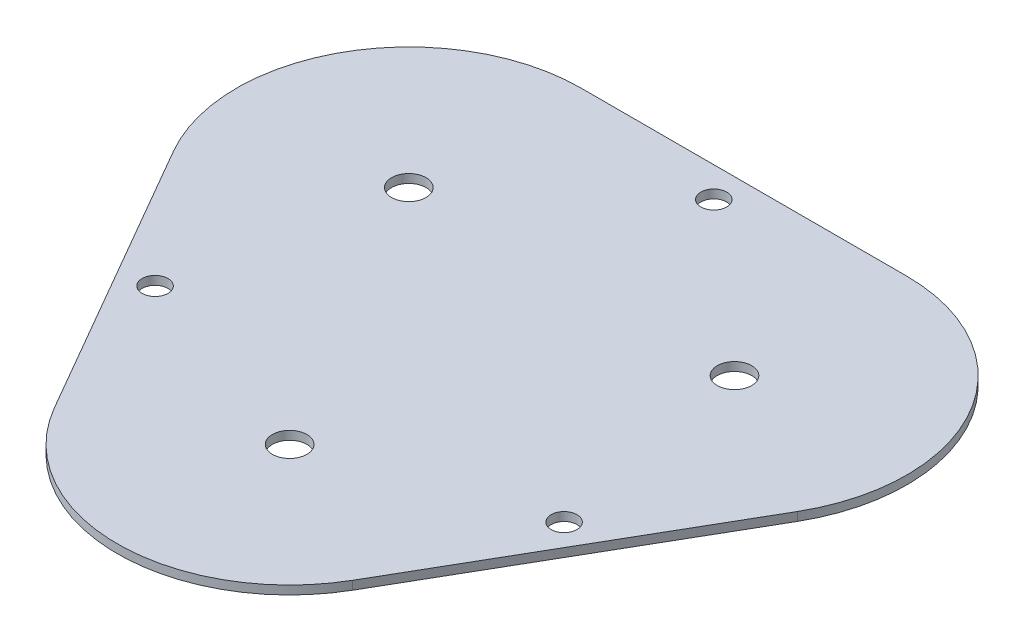
ISO-10303-21;
HEADER;
FILE_DESCRIPTION(('STEP AP214'),'2;1');
FILE_NAME('part.step','',(''),(''),'','','');
FILE_SCHEMA(('AUTOMOTIVE_DESIGN { 1 0 10303 214 1 1 1 1 }'));
ENDSEC;
DATA;
#1=APPLICATION_CONTEXT('core data for automotive mechanical design processes');
#2=APPLICATION_PROTOCOL_DEFINITION('international standard','automotive_design',2000,#1);
#3=PRODUCT_CONTEXT('',#1,'mechanical');
#4=PRODUCT('Part','Part','',(#3));
#5=PRODUCT_RELATED_PRODUCT_CATEGORY('part','',(#4));
#6=PRODUCT_DEFINITION_FORMATION('','',#4);
#7=PRODUCT_DEFINITION_CONTEXT('part definition',#1,'design');
#8=PRODUCT_DEFINITION('design','',#6,#7);
#9=PRODUCT_DEFINITION_SHAPE('','',#8);
#10=(LENGTH_UNIT() NAMED_UNIT(*) SI_UNIT(.MILLI.,.METRE.));
#11=(NAMED_UNIT(*) PLANE_ANGLE_UNIT() SI_UNIT($,.RADIAN.));
#12=(NAMED_UNIT(*) SI_UNIT($,.STERADIAN.) SOLID_ANGLE_UNIT());
#13=UNCERTAINTY_MEASURE_WITH_UNIT(LENGTH_MEASURE(1.E-05),#10,'distance_accuracy_value','');
#14=(GEOMETRIC_REPRESENTATION_CONTEXT(3) GLOBAL_UNCERTAINTY_ASSIGNED_CONTEXT((#13)) GLOBAL_UNIT_ASSIGNED_CONTEXT((#10,
#11,#12)) REPRESENTATION_CONTEXT('',''));
#15=CARTESIAN_POINT('',(0.,0.,0.));
#16=DIRECTION('',(0.,0.,1.));
#17=DIRECTION('',(1.,0.,0.));
#18=AXIS2_PLACEMENT_3D('',#15,#16,#17);
#19=CARTESIAN_POINT('',(-18.9035,1.,-10.9139408136261));
#20=DIRECTION('',(0.,1.,0.));
#21=DIRECTION('',(0.,0.,1.));
#22=AXIS2_PLACEMENT_3D('',#19,#20,#21);
#23=PLANE('',#22);
#24=CARTESIAN_POINT('',(23.7411691624432,1.,13.706970406813));
#25=DIRECTION('',(0.,1.,0.));
#26=DIRECTION('',(0.,0.,1.));
#27=AXIS2_PLACEMENT_3D('',#24,#25,#26);
#28=CIRCLE('',#27,1.5);
#29=CARTESIAN_POINT('',(23.7411691624432,1.,15.206970406813));
#30=VERTEX_POINT('',#29);
#31=EDGE_CURVE('E183',#30,#30,#28,.T.);
#32=ORIENTED_EDGE('',*,*,#31,.F.);
#33=EDGE_LOOP('',(#32));
#34=FACE_BOUND('',#33,.T.);
#35=CARTESIAN_POINT('',(0.,1.,21.8278816272522));
#36=DIRECTION('',(0.,1.,0.));
#37=DIRECTION('',(0.,0.,1.));
#38=AXIS2_PLACEMENT_3D('',#35,#36,#37);
#39=CIRCLE('',#38,2.);
#40=CARTESIAN_POINT('',(0.,1.,23.8278816272522));
#41=VERTEX_POINT('',#40);
#42=EDGE_CURVE('E171',#41,#41,#39,.T.);
#43=ORIENTED_EDGE('',*,*,#42,.F.);
#44=EDGE_LOOP('',(#43));
#45=FACE_BOUND('',#44,.T.);
#46=CARTESIAN_POINT('',(-18.9035,1.,-10.9139408136261));
#47=DIRECTION('',(0.,1.,0.));
#48=DIRECTION('',(0.,0.,1.));
#49=AXIS2_PLACEMENT_3D('',#46,#47,#48);
#50=CIRCLE('',#49,2.);
#51=CARTESIAN_POINT('',(-18.9035,1.,-8.91394081362609));
#52=VERTEX_POINT('',#51);
#53=EDGE_CURVE('E136',#52,#52,#50,.T.);
#54=ORIENTED_EDGE('',*,*,#53,.F.);
#55=EDGE_LOOP('',(#54));
#56=FACE_BOUND('',#55,.T.);
#57=CARTESIAN_POINT('',(-18.9035,1.,-10.9139408136261));
#58=DIRECTION('',(0.,1.,0.));
#59=DIRECTION('',(0.,0.,1.));
#60=AXIS2_PLACEMENT_3D('',#57,#58,#59);
#61=CIRCLE('',#60,20.);
#62=CARTESIAN_POINT('',(-18.9035,1.,-30.9139408136261));
#63=VERTEX_POINT('',#62);
#64=CARTESIAN_POINT('',(-36.2240080756888,1.,-0.913940813626082));
#65=VERTEX_POINT('',#64);
#66=EDGE_CURVE('E144',#63,#65,#61,.T.);
#67=ORIENTED_EDGE('',*,*,#66,.T.);
#68=DIRECTION('',(0.5,0.,0.866025403784438));
#69=VECTOR('',#68,1.);
#70=CARTESIAN_POINT('',(-36.2240080756888,1.,-0.913940813626082));
#71=LINE('',#70,#69);
#72=CARTESIAN_POINT('',(-17.3205080756888,1.,31.8278816272522));
#73=VERTEX_POINT('',#72);
#74=EDGE_CURVE('E94',#65,#73,#71,.T.);
#75=ORIENTED_EDGE('',*,*,#74,.T.);
#76=CARTESIAN_POINT('',(0.,1.,21.8278816272522));
#77=DIRECTION('',(0.,1.,0.));
#78=DIRECTION('',(0.,0.,1.));
#79=AXIS2_PLACEMENT_3D('',#76,#77,#78);
#80=CIRCLE('',#79,20.);
#81=CARTESIAN_POINT('',(17.3205080756888,1.,31.8278816272522));
#82=VERTEX_POINT('',#81);
#83=EDGE_CURVE('E111',#73,#82,#80,.T.);
#84=ORIENTED_EDGE('',*,*,#83,.T.);
#85=DIRECTION('',(0.5,0.,-0.866025403784439));
#86=VECTOR('',#85,1.);
#87=CARTESIAN_POINT('',(36.2240080756888,1.,-0.913940813626094));
#88=LINE('',#87,#86);
#89=CARTESIAN_POINT('',(36.2240080756888,1.,-0.913940813626094));
#90=VERTEX_POINT('',#89);
#91=EDGE_CURVE('E104',#82,#90,#88,.T.);
#92=ORIENTED_EDGE('',*,*,#91,.T.);
#93=CARTESIAN_POINT('',(18.9035,1.,-10.9139408136261));
#94=DIRECTION('',(0.,1.,0.));
#95=DIRECTION('',(0.,0.,1.));
#96=AXIS2_PLACEMENT_3D('',#93,#94,#95);
#97=CIRCLE('',#96,20.);
#98=CARTESIAN_POINT('',(18.9035,1.,-30.9139408136261));
#99=VERTEX_POINT('',#98);
#100=EDGE_CURVE('E108',#90,#99,#97,.T.);
#101=ORIENTED_EDGE('',*,*,#100,.T.);
#102=DIRECTION('',(-1.,0.,0.));
#103=VECTOR('',#102,1.);
#104=CARTESIAN_POINT('',(-18.9035,1.,-30.9139408136261));
#105=LINE('',#104,#103);
#106=EDGE_CURVE('E59',#99,#63,#105,.T.);
#107=ORIENTED_EDGE('',*,*,#106,.T.);
#108=EDGE_LOOP('',(#67,#75,#84,#92,#101,#107));
#109=FACE_BOUND('',#108,.T.);
#110=CARTESIAN_POINT('',(18.9035,1.,-10.9139408136261));
#111=DIRECTION('',(0.,1.,0.));
#112=DIRECTION('',(0.,0.,1.));
#113=AXIS2_PLACEMENT_3D('',#110,#111,#112);
#114=CIRCLE('',#113,2.);
#115=CARTESIAN_POINT('',(18.9035,1.,-8.9139408136261));
#116=VERTEX_POINT('',#115);
#117=EDGE_CURVE('E165',#116,#116,#114,.T.);
#118=ORIENTED_EDGE('',*,*,#117,.F.);
#119=EDGE_LOOP('',(#118));
#120=FACE_BOUND('',#119,.T.);
#121=CARTESIAN_POINT('',(-23.7411691624432,1.,13.706970406813));
#122=DIRECTION('',(0.,1.,0.));
#123=DIRECTION('',(0.,0.,1.));
#124=AXIS2_PLACEMENT_3D('',#121,#122,#123);
#125=CIRCLE('',#124,1.5);
#126=CARTESIAN_POINT('',(-23.7411691624432,1.,15.206970406813));
#127=VERTEX_POINT('',#126);
#128=EDGE_CURVE('E177',#127,#127,#125,.T.);
#129=ORIENTED_EDGE('',*,*,#128,.F.);
#130=EDGE_LOOP('',(#129));
#131=FACE_BOUND('',#130,.T.);
#132=CARTESIAN_POINT('',(0.,1.,-27.4139408136261));
#133=DIRECTION('',(0.,1.,0.));
#134=DIRECTION('',(0.,0.,1.));
#135=AXIS2_PLACEMENT_3D('',#132,#133,#134);
#136=CIRCLE('',#135,1.5);
#137=CARTESIAN_POINT('',(0.,1.,-25.9139408136261));
#138=VERTEX_POINT('',#137);
#139=EDGE_CURVE('E189',#138,#138,#136,.T.);
#140=ORIENTED_EDGE('',*,*,#139,.F.);
#141=EDGE_LOOP('',(#140));
#142=FACE_BOUND('',#141,.T.);
#143=ADVANCED_FACE('F35',(#34,#45,#56,#109,#120,#131,#142),#23,.T.);
#144=CARTESIAN_POINT('',(-18.9035,0.,-10.9139408136261));
#145=DIRECTION('',(0.,1.,0.));
#146=DIRECTION('',(0.,0.,1.));
#147=AXIS2_PLACEMENT_3D('',#144,#145,#146);
#148=PLANE('',#147);
#149=DIRECTION('',(-1.,0.,0.));
#150=VECTOR('',#149,1.);
#151=CARTESIAN_POINT('',(2.5,0.,-1.5));
#152=LINE('',#151,#150);
#153=CARTESIAN_POINT('',(2.5,0.,-1.5));
#154=VERTEX_POINT('',#153);
#155=CARTESIAN_POINT('',(-2.5,0.,-1.5));
#156=VERTEX_POINT('',#155);
#157=EDGE_CURVE('E208',#154,#156,#152,.T.);
#158=ORIENTED_EDGE('',*,*,#157,.T.);
#159=DIRECTION('',(0.,0.,1.));
#160=VECTOR('',#159,1.);
#161=CARTESIAN_POINT('',(-2.5,0.,-1.5));
#162=LINE('',#161,#160);
#163=CARTESIAN_POINT('',(-2.5,0.,1.5));
#164=VERTEX_POINT('',#163);
#165=EDGE_CURVE('E216',#156,#164,#162,.T.);
#166=ORIENTED_EDGE('',*,*,#165,.T.);
#167=DIRECTION('',(1.,0.,0.));
#168=VECTOR('',#167,1.);
#169=CARTESIAN_POINT('',(-2.5,0.,1.5));
#170=LINE('',#169,#168);
#171=CARTESIAN_POINT('',(2.5,0.,1.5));
#172=VERTEX_POINT('',#171);
#173=EDGE_CURVE('E213',#164,#172,#170,.T.);
#174=ORIENTED_EDGE('',*,*,#173,.T.);
#175=DIRECTION('',(0.,0.,-1.));
#176=VECTOR('',#175,1.);
#177=CARTESIAN_POINT('',(2.5,0.,1.5));
#178=LINE('',#177,#176);
#179=EDGE_CURVE('E50',#172,#154,#178,.T.);
#180=ORIENTED_EDGE('',*,*,#179,.T.);
#181=EDGE_LOOP('',(#158,#166,#174,#180));
#182=FACE_BOUND('',#181,.T.);
#183=CARTESIAN_POINT('',(-18.9035,0.,-10.9139408136261));
#184=DIRECTION('',(0.,1.,0.));
#185=DIRECTION('',(0.,0.,1.));
#186=AXIS2_PLACEMENT_3D('',#183,#184,#185);
#187=CIRCLE('',#186,20.);
#188=CARTESIAN_POINT('',(-18.9035,0.,-30.9139408136261));
#189=VERTEX_POINT('',#188);
#190=CARTESIAN_POINT('',(-36.2240080756888,0.,-0.913940813626082));
#191=VERTEX_POINT('',#190);
#192=EDGE_CURVE('E132',#189,#191,#187,.T.);
#193=ORIENTED_EDGE('',*,*,#192,.F.);
#194=DIRECTION('',(-1.,0.,0.));
#195=VECTOR('',#194,1.);
#196=CARTESIAN_POINT('',(-18.9035,0.,-30.9139408136261));
#197=LINE('',#196,#195);
#198=CARTESIAN_POINT('',(18.9035,0.,-30.9139408136261));
#199=VERTEX_POINT('',#198);
#200=EDGE_CURVE('E86',#199,#189,#197,.T.);
#201=ORIENTED_EDGE('',*,*,#200,.F.);
#202=CARTESIAN_POINT('',(18.9035,0.,-10.9139408136261));
#203=DIRECTION('',(0.,1.,0.));
#204=DIRECTION('',(0.,0.,1.));
#205=AXIS2_PLACEMENT_3D('',#202,#203,#204);
#206=CIRCLE('',#205,20.);
#207=CARTESIAN_POINT('',(36.2240080756888,0.,-0.913940813626094));
#208=VERTEX_POINT('',#207);
#209=EDGE_CURVE('E141',#208,#199,#206,.T.);
#210=ORIENTED_EDGE('',*,*,#209,.F.);
#211=DIRECTION('',(0.5,0.,-0.866025403784439));
#212=VECTOR('',#211,1.);
#213=CARTESIAN_POINT('',(36.2240080756888,0.,-0.913940813626094));
#214=LINE('',#213,#212);
#215=CARTESIAN_POINT('',(17.3205080756888,0.,31.8278816272522));
#216=VERTEX_POINT('',#215);
#217=EDGE_CURVE('E120',#216,#208,#214,.T.);
#218=ORIENTED_EDGE('',*,*,#217,.F.);
#219=CARTESIAN_POINT('',(0.,0.,21.8278816272522));
#220=DIRECTION('',(0.,1.,0.));
#221=DIRECTION('',(0.,0.,1.));
#222=AXIS2_PLACEMENT_3D('',#219,#220,#221);
#223=CIRCLE('',#222,20.);
#224=CARTESIAN_POINT('',(-17.3205080756888,0.,31.8278816272522));
#225=VERTEX_POINT('',#224);
#226=EDGE_CURVE('E138',#225,#216,#223,.T.);
#227=ORIENTED_EDGE('',*,*,#226,.F.);
#228=DIRECTION('',(0.5,0.,0.866025403784438));
#229=VECTOR('',#228,1.);
#230=CARTESIAN_POINT('',(-36.2240080756888,0.,-0.913940813626082));
#231=LINE('',#230,#229);
#232=EDGE_CURVE('E135',#191,#225,#231,.T.);
#233=ORIENTED_EDGE('',*,*,#232,.F.);
#234=EDGE_LOOP('',(#193,#201,#210,#218,#227,#233));
#235=FACE_BOUND('',#234,.T.);
#236=CARTESIAN_POINT('',(-18.9035,0.,-10.9139408136261));
#237=DIRECTION('',(0.,1.,0.));
#238=DIRECTION('',(0.,0.,1.));
#239=AXIS2_PLACEMENT_3D('',#236,#237,#238);
#240=CIRCLE('',#239,2.);
#241=CARTESIAN_POINT('',(-18.9035,0.,-8.91394081362609));
#242=VERTEX_POINT('',#241);
#243=EDGE_CURVE('E162',#242,#242,#240,.T.);
#244=ORIENTED_EDGE('',*,*,#243,.T.);
#245=EDGE_LOOP('',(#244));
#246=FACE_BOUND('',#245,.T.);
#247=CARTESIAN_POINT('',(18.9035,0.,-10.9139408136261));
#248=DIRECTION('',(0.,1.,0.));
#249=DIRECTION('',(0.,0.,1.));
#250=AXIS2_PLACEMENT_3D('',#247,#248,#249);
#251=CIRCLE('',#250,2.);
#252=CARTESIAN_POINT('',(18.9035,0.,-8.9139408136261));
#253=VERTEX_POINT('',#252);
#254=EDGE_CURVE('E168',#253,#253,#251,.T.);
#255=ORIENTED_EDGE('',*,*,#254,.T.);
#256=EDGE_LOOP('',(#255));
#257=FACE_BOUND('',#256,.T.);
#258=CARTESIAN_POINT('',(0.,0.,21.8278816272522));
#259=DIRECTION('',(0.,1.,0.));
#260=DIRECTION('',(0.,0.,1.));
#261=AXIS2_PLACEMENT_3D('',#258,#259,#260);
#262=CIRCLE('',#261,2.);
#263=CARTESIAN_POINT('',(0.,0.,23.8278816272522));
#264=VERTEX_POINT('',#263);
#265=EDGE_CURVE('E174',#264,#264,#262,.T.);
#266=ORIENTED_EDGE('',*,*,#265,.T.);
#267=EDGE_LOOP('',(#266));
#268=FACE_BOUND('',#267,.T.);
#269=CARTESIAN_POINT('',(-23.7411691624432,0.,13.706970406813));
#270=DIRECTION('',(0.,1.,0.));
#271=DIRECTION('',(0.,0.,1.));
#272=AXIS2_PLACEMENT_3D('',#269,#270,#271);
#273=CIRCLE('',#272,1.5);
#274=CARTESIAN_POINT('',(-23.7411691624432,0.,15.206970406813));
#275=VERTEX_POINT('',#274);
#276=EDGE_CURVE('E180',#275,#275,#273,.T.);
#277=ORIENTED_EDGE('',*,*,#276,.T.);
#278=EDGE_LOOP('',(#277));
#279=FACE_BOUND('',#278,.T.);
#280=CARTESIAN_POINT('',(23.7411691624432,0.,13.706970406813));
#281=DIRECTION('',(0.,1.,0.));
#282=DIRECTION('',(0.,0.,1.));
#283=AXIS2_PLACEMENT_3D('',#280,#281,#282);
#284=CIRCLE('',#283,1.5);
#285=CARTESIAN_POINT('',(23.7411691624432,0.,15.206970406813));
#286=VERTEX_POINT('',#285);
#287=EDGE_CURVE('E186',#286,#286,#284,.T.);
#288=ORIENTED_EDGE('',*,*,#287,.T.);
#289=EDGE_LOOP('',(#288));
#290=FACE_BOUND('',#289,.T.);
#291=CARTESIAN_POINT('',(0.,0.,-27.4139408136261));
#292=DIRECTION('',(0.,1.,0.));
#293=DIRECTION('',(0.,0.,1.));
#294=AXIS2_PLACEMENT_3D('',#291,#292,#293);
#295=CIRCLE('',#294,1.5);
#296=CARTESIAN_POINT('',(0.,0.,-25.9139408136261));
#297=VERTEX_POINT('',#296);
#298=EDGE_CURVE('E192',#297,#297,#295,.T.);
#299=ORIENTED_EDGE('',*,*,#298,.T.);
#300=EDGE_LOOP('',(#299));
#301=FACE_BOUND('',#300,.T.);
#302=ADVANCED_FACE('F153',(#182,#235,#246,#257,#268,#279,#290,#301),#148,.F.);
#303=CARTESIAN_POINT('',(-18.9035,1.,-10.9139408136261));
#304=DIRECTION('',(0.,-1.,0.));
#305=DIRECTION('',(0.,0.,-1.));
#306=AXIS2_PLACEMENT_3D('',#303,#304,#305);
#307=CYLINDRICAL_SURFACE('',#306,20.);
#308=ORIENTED_EDGE('',*,*,#192,.T.);
#309=DIRECTION('',(0.,-1.,0.));
#310=VECTOR('',#309,1.);
#311=CARTESIAN_POINT('',(-36.2240080756888,1.,-0.913940813626082));
#312=LINE('',#311,#310);
#313=EDGE_CURVE('E11',#65,#191,#312,.T.);
#314=ORIENTED_EDGE('',*,*,#313,.F.);
#315=ORIENTED_EDGE('',*,*,#66,.F.);
#316=DIRECTION('',(0.,-1.,0.));
#317=VECTOR('',#316,1.);
#318=CARTESIAN_POINT('',(-18.9035,1.,-30.9139408136261));
#319=LINE('',#318,#317);
#320=EDGE_CURVE('E128',#63,#189,#319,.T.);
#321=ORIENTED_EDGE('',*,*,#320,.T.);
#322=EDGE_LOOP('',(#308,#314,#315,#321));
#323=FACE_BOUND('',#322,.T.);
#324=ADVANCED_FACE('F37',(#323),#307,.T.);
#325=CARTESIAN_POINT('',(-36.2240080756888,1.,-0.913940813626082));
#326=DIRECTION('',(0.866025403784439,0.,-0.5));
#327=DIRECTION('',(-0.5,0.,-0.866025403784438));
#328=AXIS2_PLACEMENT_3D('',#325,#326,#327);
#329=PLANE('',#328);
#330=ORIENTED_EDGE('',*,*,#232,.T.);
#331=DIRECTION('',(0.,-1.,0.));
#332=VECTOR('',#331,1.);
#333=CARTESIAN_POINT('',(-17.3205080756888,1.,31.8278816272522));
#334=LINE('',#333,#332);
#335=EDGE_CURVE('E43',#73,#225,#334,.T.);
#336=ORIENTED_EDGE('',*,*,#335,.F.);
#337=ORIENTED_EDGE('',*,*,#74,.F.);
#338=ORIENTED_EDGE('',*,*,#313,.T.);
#339=EDGE_LOOP('',(#330,#336,#337,#338));
#340=FACE_BOUND('',#339,.T.);
#341=ADVANCED_FACE('F264',(#340),#329,.F.);
#342=CARTESIAN_POINT('',(0.,1.,21.8278816272522));
#343=DIRECTION('',(0.,-1.,0.));
#344=DIRECTION('',(0.,0.,-1.));
#345=AXIS2_PLACEMENT_3D('',#342,#343,#344);
#346=CYLINDRICAL_SURFACE('',#345,20.);
#347=ORIENTED_EDGE('',*,*,#226,.T.);
#348=DIRECTION('',(0.,-1.,0.));
#349=VECTOR('',#348,1.);
#350=CARTESIAN_POINT('',(17.3205080756888,1.,31.8278816272522));
#351=LINE('',#350,#349);
#352=EDGE_CURVE('E123',#82,#216,#351,.T.);
#353=ORIENTED_EDGE('',*,*,#352,.F.);
#354=ORIENTED_EDGE('',*,*,#83,.F.);
#355=ORIENTED_EDGE('',*,*,#335,.T.);
#356=EDGE_LOOP('',(#347,#353,#354,#355));
#357=FACE_BOUND('',#356,.T.);
#358=ADVANCED_FACE('F150',(#357),#346,.T.);
#359=CARTESIAN_POINT('',(36.2240080756888,1.,-0.913940813626094));
#360=DIRECTION('',(-0.866025403784439,0.,-0.5));
#361=DIRECTION('',(-0.5,0.,0.866025403784439));
#362=AXIS2_PLACEMENT_3D('',#359,#360,#361);
#363=PLANE('',#362);
#364=ORIENTED_EDGE('',*,*,#217,.T.);
#365=DIRECTION('',(0.,-1.,0.));
#366=VECTOR('',#365,1.);
#367=CARTESIAN_POINT('',(36.2240080756888,1.,-0.913940813626094));
#368=LINE('',#367,#366);
#369=EDGE_CURVE('E117',#90,#208,#368,.T.);
#370=ORIENTED_EDGE('',*,*,#369,.F.);
#371=ORIENTED_EDGE('',*,*,#91,.F.);
#372=ORIENTED_EDGE('',*,*,#352,.T.);
#373=EDGE_LOOP('',(#364,#370,#371,#372));
#374=FACE_BOUND('',#373,.T.);
#375=ADVANCED_FACE('F118',(#374),#363,.F.);
#376=CARTESIAN_POINT('',(18.9035,1.,-10.9139408136261));
#377=DIRECTION('',(0.,-1.,0.));
#378=DIRECTION('',(0.,0.,-1.));
#379=AXIS2_PLACEMENT_3D('',#376,#377,#378);
#380=CYLINDRICAL_SURFACE('',#379,20.);
#381=ORIENTED_EDGE('',*,*,#209,.T.);
#382=DIRECTION('',(0.,-1.,0.));
#383=VECTOR('',#382,1.);
#384=CARTESIAN_POINT('',(18.9035,1.,-30.9139408136261));
#385=LINE('',#384,#383);
#386=EDGE_CURVE('E124',#99,#199,#385,.T.);
#387=ORIENTED_EDGE('',*,*,#386,.F.);
#388=ORIENTED_EDGE('',*,*,#100,.F.);
#389=ORIENTED_EDGE('',*,*,#369,.T.);
#390=EDGE_LOOP('',(#381,#387,#388,#389));
#391=FACE_BOUND('',#390,.T.);
#392=ADVANCED_FACE('F126',(#391),#380,.T.);
#393=CARTESIAN_POINT('',(-18.9035,1.,-30.9139408136261));
#394=DIRECTION('',(0.,0.,1.));
#395=DIRECTION('',(1.,0.,0.));
#396=AXIS2_PLACEMENT_3D('',#393,#394,#395);
#397=PLANE('',#396);
#398=ORIENTED_EDGE('',*,*,#200,.T.);
#399=ORIENTED_EDGE('',*,*,#320,.F.);
#400=ORIENTED_EDGE('',*,*,#106,.F.);
#401=ORIENTED_EDGE('',*,*,#386,.T.);
#402=EDGE_LOOP('',(#398,#399,#400,#401));
#403=FACE_BOUND('',#402,.T.);
#404=ADVANCED_FACE('F155',(#403),#397,.F.);
#405=CARTESIAN_POINT('',(-18.9035,1.,-10.9139408136261));
#406=DIRECTION('',(0.,-1.,0.));
#407=DIRECTION('',(0.,0.,-1.));
#408=AXIS2_PLACEMENT_3D('',#405,#406,#407);
#409=CYLINDRICAL_SURFACE('',#408,2.);
#410=ORIENTED_EDGE('',*,*,#53,.T.);
#411=EDGE_LOOP('',(#410));
#412=FACE_BOUND('',#411,.T.);
#413=ORIENTED_EDGE('',*,*,#243,.F.);
#414=EDGE_LOOP('',(#413));
#415=FACE_BOUND('',#414,.T.);
#416=ADVANCED_FACE('F271',(#412,#415),#409,.F.);
#417=CARTESIAN_POINT('',(18.9035,1.,-10.9139408136261));
#418=DIRECTION('',(0.,-1.,0.));
#419=DIRECTION('',(0.,0.,-1.));
#420=AXIS2_PLACEMENT_3D('',#417,#418,#419);
#421=CYLINDRICAL_SURFACE('',#420,2.);
#422=ORIENTED_EDGE('',*,*,#117,.T.);
#423=EDGE_LOOP('',(#422));
#424=FACE_BOUND('',#423,.T.);
#425=ORIENTED_EDGE('',*,*,#254,.F.);
#426=EDGE_LOOP('',(#425));
#427=FACE_BOUND('',#426,.T.);
#428=ADVANCED_FACE('F304',(#424,#427),#421,.F.);
#429=CARTESIAN_POINT('',(0.,1.,21.8278816272522));
#430=DIRECTION('',(0.,-1.,0.));
#431=DIRECTION('',(0.,0.,-1.));
#432=AXIS2_PLACEMENT_3D('',#429,#430,#431);
#433=CYLINDRICAL_SURFACE('',#432,2.);
#434=ORIENTED_EDGE('',*,*,#42,.T.);
#435=EDGE_LOOP('',(#434));
#436=FACE_BOUND('',#435,.T.);
#437=ORIENTED_EDGE('',*,*,#265,.F.);
#438=EDGE_LOOP('',(#437));
#439=FACE_BOUND('',#438,.T.);
#440=ADVANCED_FACE('F311',(#436,#439),#433,.F.);
#441=CARTESIAN_POINT('',(-23.7411691624432,1.,13.706970406813));
#442=DIRECTION('',(0.,-1.,0.));
#443=DIRECTION('',(0.,0.,-1.));
#444=AXIS2_PLACEMENT_3D('',#441,#442,#443);
#445=CYLINDRICAL_SURFACE('',#444,1.5);
#446=ORIENTED_EDGE('',*,*,#128,.T.);
#447=EDGE_LOOP('',(#446));
#448=FACE_BOUND('',#447,.T.);
#449=ORIENTED_EDGE('',*,*,#276,.F.);
#450=EDGE_LOOP('',(#449));
#451=FACE_BOUND('',#450,.T.);
#452=ADVANCED_FACE('F319',(#448,#451),#445,.F.);
#453=CARTESIAN_POINT('',(23.7411691624432,1.,13.706970406813));
#454=DIRECTION('',(0.,-1.,0.));
#455=DIRECTION('',(0.,0.,-1.));
#456=AXIS2_PLACEMENT_3D('',#453,#454,#455);
#457=CYLINDRICAL_SURFACE('',#456,1.5);
#458=ORIENTED_EDGE('',*,*,#31,.T.);
#459=EDGE_LOOP('',(#458));
#460=FACE_BOUND('',#459,.T.);
#461=ORIENTED_EDGE('',*,*,#287,.F.);
#462=EDGE_LOOP('',(#461));
#463=FACE_BOUND('',#462,.T.);
#464=ADVANCED_FACE('F327',(#460,#463),#457,.F.);
#465=CARTESIAN_POINT('',(0.,1.,-27.4139408136261));
#466=DIRECTION('',(0.,-1.,0.));
#467=DIRECTION('',(0.,0.,-1.));
#468=AXIS2_PLACEMENT_3D('',#465,#466,#467);
#469=CYLINDRICAL_SURFACE('',#468,1.5);
#470=ORIENTED_EDGE('',*,*,#139,.T.);
#471=EDGE_LOOP('',(#470));
#472=FACE_BOUND('',#471,.T.);
#473=ORIENTED_EDGE('',*,*,#298,.F.);
#474=EDGE_LOOP('',(#473));
#475=FACE_BOUND('',#474,.T.);
#476=ADVANCED_FACE('F335',(#472,#475),#469,.F.);
#477=CARTESIAN_POINT('',(-2.5,-4.,-1.5));
#478=DIRECTION('',(-1.,0.,0.));
#479=DIRECTION('',(0.,0.,1.));
#480=AXIS2_PLACEMENT_3D('',#477,#478,#479);
#481=PLANE('',#480);
#482=ORIENTED_EDGE('',*,*,#165,.F.);
#483=DIRECTION('',(0.,1.,0.));
#484=VECTOR('',#483,1.);
#485=CARTESIAN_POINT('',(-2.5,-4.,-1.5));
#486=LINE('',#485,#484);
#487=CARTESIAN_POINT('',(-2.5,-4.,-1.5));
#488=VERTEX_POINT('',#487);
#489=EDGE_CURVE('E195',#488,#156,#486,.T.);
#490=ORIENTED_EDGE('',*,*,#489,.F.);
#491=DIRECTION('',(0.,0.,1.));
#492=VECTOR('',#491,1.);
#493=CARTESIAN_POINT('',(-2.5,-4.,-1.5));
#494=LINE('',#493,#492);
#495=CARTESIAN_POINT('',(-2.5,-4.,1.5));
#496=VERTEX_POINT('',#495);
#497=EDGE_CURVE('E211',#488,#496,#494,.T.);
#498=ORIENTED_EDGE('',*,*,#497,.T.);
#499=DIRECTION('',(0.,1.,0.));
#500=VECTOR('',#499,1.);
#501=CARTESIAN_POINT('',(-2.5,-4.,1.5));
#502=LINE('',#501,#500);
#503=EDGE_CURVE('E198',#496,#164,#502,.T.);
#504=ORIENTED_EDGE('',*,*,#503,.T.);
#505=EDGE_LOOP('',(#482,#490,#498,#504));
#506=FACE_BOUND('',#505,.T.);
#507=ADVANCED_FACE('F233',(#506),#481,.T.);
#508=CARTESIAN_POINT('',(2.5,-4.,-1.5));
#509=DIRECTION('',(0.,0.,-1.));
#510=DIRECTION('',(-1.,0.,0.));
#511=AXIS2_PLACEMENT_3D('',#508,#509,#510);
#512=PLANE('',#511);
#513=ORIENTED_EDGE('',*,*,#157,.F.);
#514=DIRECTION('',(0.,1.,0.));
#515=VECTOR('',#514,1.);
#516=CARTESIAN_POINT('',(2.5,-4.,-1.5));
#517=LINE('',#516,#515);
#518=CARTESIAN_POINT('',(2.5,-4.,-1.5));
#519=VERTEX_POINT('',#518);
#520=EDGE_CURVE('E204',#519,#154,#517,.T.);
#521=ORIENTED_EDGE('',*,*,#520,.F.);
#522=DIRECTION('',(-1.,0.,0.));
#523=VECTOR('',#522,1.);
#524=CARTESIAN_POINT('',(2.5,-4.,-1.5));
#525=LINE('',#524,#523);
#526=EDGE_CURVE('E202',#519,#488,#525,.T.);
#527=ORIENTED_EDGE('',*,*,#526,.T.);
#528=ORIENTED_EDGE('',*,*,#489,.T.);
#529=EDGE_LOOP('',(#513,#521,#527,#528));
#530=FACE_BOUND('',#529,.T.);
#531=ADVANCED_FACE('F249',(#530),#512,.T.);
#532=CARTESIAN_POINT('',(2.5,-4.,1.5));
#533=DIRECTION('',(1.,0.,0.));
#534=DIRECTION('',(0.,0.,-1.));
#535=AXIS2_PLACEMENT_3D('',#532,#533,#534);
#536=PLANE('',#535);
#537=ORIENTED_EDGE('',*,*,#179,.F.);
#538=DIRECTION('',(0.,1.,0.));
#539=VECTOR('',#538,1.);
#540=CARTESIAN_POINT('',(2.5,-4.,1.5));
#541=LINE('',#540,#539);
#542=CARTESIAN_POINT('',(2.5,-4.,1.5));
#543=VERTEX_POINT('',#542);
#544=EDGE_CURVE('E201',#543,#172,#541,.T.);
#545=ORIENTED_EDGE('',*,*,#544,.F.);
#546=DIRECTION('',(0.,0.,-1.));
#547=VECTOR('',#546,1.);
#548=CARTESIAN_POINT('',(2.5,-4.,1.5));
#549=LINE('',#548,#547);
#550=EDGE_CURVE('E221',#543,#519,#549,.T.);
#551=ORIENTED_EDGE('',*,*,#550,.T.);
#552=ORIENTED_EDGE('',*,*,#520,.T.);
#553=EDGE_LOOP('',(#537,#545,#551,#552));
#554=FACE_BOUND('',#553,.T.);
#555=ADVANCED_FACE('F252',(#554),#536,.T.);
#556=CARTESIAN_POINT('',(-2.5,-4.,1.5));
#557=DIRECTION('',(0.,0.,1.));
#558=DIRECTION('',(1.,0.,0.));
#559=AXIS2_PLACEMENT_3D('',#556,#557,#558);
#560=PLANE('',#559);
#561=ORIENTED_EDGE('',*,*,#173,.F.);
#562=ORIENTED_EDGE('',*,*,#503,.F.);
#563=DIRECTION('',(1.,0.,0.));
#564=VECTOR('',#563,1.);
#565=CARTESIAN_POINT('',(-2.5,-4.,1.5));
#566=LINE('',#565,#564);
#567=EDGE_CURVE('E224',#496,#543,#566,.T.);
#568=ORIENTED_EDGE('',*,*,#567,.T.);
#569=ORIENTED_EDGE('',*,*,#544,.T.);
#570=EDGE_LOOP('',(#561,#562,#568,#569));
#571=FACE_BOUND('',#570,.T.);
#572=ADVANCED_FACE('F255',(#571),#560,.T.);
#573=CARTESIAN_POINT('',(0.,-4.,0.));
#574=DIRECTION('',(0.,1.,0.));
#575=DIRECTION('',(0.,0.,1.));
#576=AXIS2_PLACEMENT_3D('',#573,#574,#575);
#577=PLANE('',#576);
#578=ORIENTED_EDGE('',*,*,#497,.F.);
#579=ORIENTED_EDGE('',*,*,#526,.F.);
#580=ORIENTED_EDGE('',*,*,#550,.F.);
#581=ORIENTED_EDGE('',*,*,#567,.F.);
#582=EDGE_LOOP('',(#578,#579,#580,#581));
#583=FACE_BOUND('',#582,.T.);
#584=ADVANCED_FACE('F242',(#583),#577,.F.);
#585=CLOSED_SHELL('',(#143,#302,#324,#341,#358,#375,#392,#404,#416,#428,#440,#452,#464,#476,
#507,#531,#555,#572,#584));
#586=MANIFOLD_SOLID_BREP('B2',#585);
#587=ADVANCED_BREP_SHAPE_REPRESENTATION('',(#18,#586),#14);
#588=SHAPE_DEFINITION_REPRESENTATION(#9,#587);
ENDSEC;
END-ISO-10303-21;
